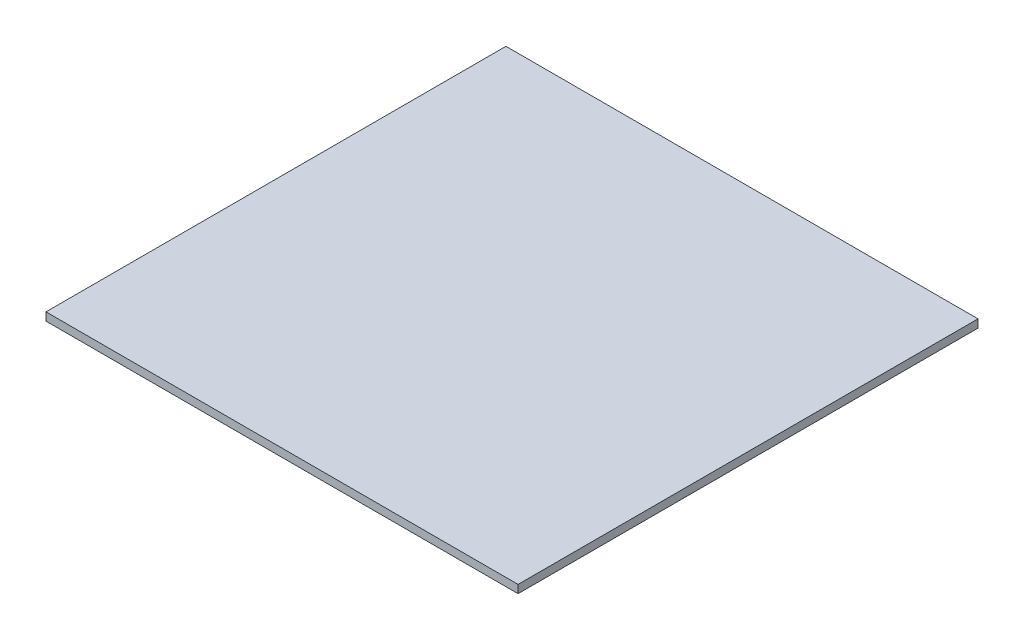
ISO-10303-21;
HEADER;
FILE_DESCRIPTION(('STEP AP214'),'2;1');
FILE_NAME('part.step','',(''),(''),'','','');
FILE_SCHEMA(('AUTOMOTIVE_DESIGN { 1 0 10303 214 1 1 1 1 }'));
ENDSEC;
DATA;
#1=APPLICATION_CONTEXT('core data for automotive mechanical design processes');
#2=APPLICATION_PROTOCOL_DEFINITION('international standard','automotive_design',2000,#1);
#3=PRODUCT_CONTEXT('',#1,'mechanical');
#4=PRODUCT('Part','Part','',(#3));
#5=PRODUCT_RELATED_PRODUCT_CATEGORY('part','',(#4));
#6=PRODUCT_DEFINITION_FORMATION('','',#4);
#7=PRODUCT_DEFINITION_CONTEXT('part definition',#1,'design');
#8=PRODUCT_DEFINITION('design','',#6,#7);
#9=PRODUCT_DEFINITION_SHAPE('','',#8);
#10=(LENGTH_UNIT() NAMED_UNIT(*) SI_UNIT(.MILLI.,.METRE.));
#11=(NAMED_UNIT(*) PLANE_ANGLE_UNIT() SI_UNIT($,.RADIAN.));
#12=(NAMED_UNIT(*) SI_UNIT($,.STERADIAN.) SOLID_ANGLE_UNIT());
#13=UNCERTAINTY_MEASURE_WITH_UNIT(LENGTH_MEASURE(1.E-05),#10,'distance_accuracy_value','');
#14=(GEOMETRIC_REPRESENTATION_CONTEXT(3) GLOBAL_UNCERTAINTY_ASSIGNED_CONTEXT((#13)) GLOBAL_UNIT_ASSIGNED_CONTEXT((#10,
#11,#12)) REPRESENTATION_CONTEXT('',''));
#15=CARTESIAN_POINT('',(0.,0.,0.));
#16=DIRECTION('',(0.,0.,1.));
#17=DIRECTION('',(1.,0.,0.));
#18=AXIS2_PLACEMENT_3D('',#15,#16,#17);
#19=CARTESIAN_POINT('',(10900.,20525.,5700.00000000006));
#20=DIRECTION('',(-1.,0.,0.));
#21=DIRECTION('',(0.,0.,1.));
#22=AXIS2_PLACEMENT_3D('',#19,#20,#21);
#23=PLANE('',#22);
#24=DIRECTION('',(0.,0.,-1.));
#25=VECTOR('',#24,1.);
#26=CARTESIAN_POINT('',(10900.,20425.,5700.00000000006));
#27=LINE('',#26,#25);
#28=CARTESIAN_POINT('',(10900.,20425.,5700.00000000006));
#29=VERTEX_POINT('',#28);
#30=CARTESIAN_POINT('',(10900.,20425.,6.3948846218409E-11));
#31=VERTEX_POINT('',#30);
#32=EDGE_CURVE('E93',#29,#31,#27,.T.);
#33=ORIENTED_EDGE('',*,*,#32,.T.);
#34=DIRECTION('',(0.,-1.,0.));
#35=VECTOR('',#34,1.);
#36=CARTESIAN_POINT('',(10900.,20525.,6.3948846218409E-11));
#37=LINE('',#36,#35);
#38=CARTESIAN_POINT('',(10900.,20525.,6.3948846218409E-11));
#39=VERTEX_POINT('',#38);
#40=EDGE_CURVE('E11',#39,#31,#37,.T.);
#41=ORIENTED_EDGE('',*,*,#40,.F.);
#42=DIRECTION('',(0.,0.,-1.));
#43=VECTOR('',#42,1.);
#44=CARTESIAN_POINT('',(10900.,20525.,5700.00000000006));
#45=LINE('',#44,#43);
#46=CARTESIAN_POINT('',(10900.,20525.,5700.00000000006));
#47=VERTEX_POINT('',#46);
#48=EDGE_CURVE('E81',#47,#39,#45,.T.);
#49=ORIENTED_EDGE('',*,*,#48,.F.);
#50=DIRECTION('',(0.,-1.,0.));
#51=VECTOR('',#50,1.);
#52=CARTESIAN_POINT('',(10900.,20525.,5700.00000000006));
#53=LINE('',#52,#51);
#54=EDGE_CURVE('E89',#47,#29,#53,.T.);
#55=ORIENTED_EDGE('',*,*,#54,.T.);
#56=EDGE_LOOP('',(#33,#41,#49,#55));
#57=FACE_BOUND('',#56,.T.);
#58=ADVANCED_FACE('F30',(#57),#23,.F.);
#59=CARTESIAN_POINT('',(10900.,20525.,6.3948846218409E-11));
#60=DIRECTION('',(0.,0.,1.));
#61=DIRECTION('',(1.,0.,0.));
#62=AXIS2_PLACEMENT_3D('',#59,#60,#61);
#63=PLANE('',#62);
#64=DIRECTION('',(-1.,0.,0.));
#65=VECTOR('',#64,1.);
#66=CARTESIAN_POINT('',(10900.,20425.,6.3948846218409E-11));
#67=LINE('',#66,#65);
#68=CARTESIAN_POINT('',(5050.,20425.,7.46069872548105E-11));
#69=VERTEX_POINT('',#68);
#70=EDGE_CURVE('E85',#31,#69,#67,.T.);
#71=ORIENTED_EDGE('',*,*,#70,.T.);
#72=DIRECTION('',(0.,-1.,0.));
#73=VECTOR('',#72,1.);
#74=CARTESIAN_POINT('',(5050.,20525.,7.46069872548105E-11));
#75=LINE('',#74,#73);
#76=CARTESIAN_POINT('',(5050.,20525.,7.46069872548105E-11));
#77=VERTEX_POINT('',#76);
#78=EDGE_CURVE('E38',#77,#69,#75,.T.);
#79=ORIENTED_EDGE('',*,*,#78,.F.);
#80=DIRECTION('',(-1.,0.,0.));
#81=VECTOR('',#80,1.);
#82=CARTESIAN_POINT('',(10900.,20525.,6.3948846218409E-11));
#83=LINE('',#82,#81);
#84=EDGE_CURVE('E76',#39,#77,#83,.T.);
#85=ORIENTED_EDGE('',*,*,#84,.F.);
#86=ORIENTED_EDGE('',*,*,#40,.T.);
#87=EDGE_LOOP('',(#71,#79,#85,#86));
#88=FACE_BOUND('',#87,.T.);
#89=ADVANCED_FACE('F84',(#88),#63,.F.);
#90=CARTESIAN_POINT('',(5050.,20525.,5700.00000000001));
#91=DIRECTION('',(1.,0.,0.));
#92=DIRECTION('',(0.,0.,-1.));
#93=AXIS2_PLACEMENT_3D('',#90,#91,#92);
#94=PLANE('',#93);
#95=DIRECTION('',(0.,0.,1.));
#96=VECTOR('',#95,1.);
#97=CARTESIAN_POINT('',(5050.,20425.,5700.00000000001));
#98=LINE('',#97,#96);
#99=CARTESIAN_POINT('',(5050.,20425.,5700.00000000001));
#100=VERTEX_POINT('',#99);
#101=EDGE_CURVE('E63',#69,#100,#98,.T.);
#102=ORIENTED_EDGE('',*,*,#101,.T.);
#103=DIRECTION('',(0.,-1.,0.));
#104=VECTOR('',#103,1.);
#105=CARTESIAN_POINT('',(5050.,20525.,5700.00000000001));
#106=LINE('',#105,#104);
#107=CARTESIAN_POINT('',(5050.,20525.,5700.00000000001));
#108=VERTEX_POINT('',#107);
#109=EDGE_CURVE('E86',#108,#100,#106,.T.);
#110=ORIENTED_EDGE('',*,*,#109,.F.);
#111=DIRECTION('',(0.,0.,1.));
#112=VECTOR('',#111,1.);
#113=CARTESIAN_POINT('',(5050.,20525.,5700.00000000001));
#114=LINE('',#113,#112);
#115=EDGE_CURVE('E79',#77,#108,#114,.T.);
#116=ORIENTED_EDGE('',*,*,#115,.F.);
#117=ORIENTED_EDGE('',*,*,#78,.T.);
#118=EDGE_LOOP('',(#102,#110,#116,#117));
#119=FACE_BOUND('',#118,.T.);
#120=ADVANCED_FACE('F87',(#119),#94,.F.);
#121=CARTESIAN_POINT('',(10900.,20525.,5700.00000000006));
#122=DIRECTION('',(0.,0.,-1.));
#123=DIRECTION('',(-1.,0.,0.));
#124=AXIS2_PLACEMENT_3D('',#121,#122,#123);
#125=PLANE('',#124);
#126=DIRECTION('',(1.,0.,0.));
#127=VECTOR('',#126,1.);
#128=CARTESIAN_POINT('',(10900.,20425.,5700.00000000006));
#129=LINE('',#128,#127);
#130=EDGE_CURVE('E69',#100,#29,#129,.T.);
#131=ORIENTED_EDGE('',*,*,#130,.T.);
#132=ORIENTED_EDGE('',*,*,#54,.F.);
#133=DIRECTION('',(1.,0.,0.));
#134=VECTOR('',#133,1.);
#135=CARTESIAN_POINT('',(10900.,20525.,5700.00000000006));
#136=LINE('',#135,#134);
#137=EDGE_CURVE('E46',#108,#47,#136,.T.);
#138=ORIENTED_EDGE('',*,*,#137,.F.);
#139=ORIENTED_EDGE('',*,*,#109,.T.);
#140=EDGE_LOOP('',(#131,#132,#138,#139));
#141=FACE_BOUND('',#140,.T.);
#142=ADVANCED_FACE('F100',(#141),#125,.F.);
#143=CARTESIAN_POINT('',(10900.,20525.,6.3948846218409E-11));
#144=DIRECTION('',(0.,1.,0.));
#145=DIRECTION('',(0.,0.,1.));
#146=AXIS2_PLACEMENT_3D('',#143,#144,#145);
#147=PLANE('',#146);
#148=ORIENTED_EDGE('',*,*,#48,.T.);
#149=ORIENTED_EDGE('',*,*,#84,.T.);
#150=ORIENTED_EDGE('',*,*,#115,.T.);
#151=ORIENTED_EDGE('',*,*,#137,.T.);
#152=EDGE_LOOP('',(#148,#149,#150,#151));
#153=FACE_BOUND('',#152,.T.);
#154=ADVANCED_FACE('F77',(#153),#147,.T.);
#155=CARTESIAN_POINT('',(10900.,20425.,6.3948846218409E-11));
#156=DIRECTION('',(0.,1.,0.));
#157=DIRECTION('',(0.,0.,1.));
#158=AXIS2_PLACEMENT_3D('',#155,#156,#157);
#159=PLANE('',#158);
#160=ORIENTED_EDGE('',*,*,#32,.F.);
#161=ORIENTED_EDGE('',*,*,#130,.F.);
#162=ORIENTED_EDGE('',*,*,#101,.F.);
#163=ORIENTED_EDGE('',*,*,#70,.F.);
#164=EDGE_LOOP('',(#160,#161,#162,#163));
#165=FACE_BOUND('',#164,.T.);
#166=ADVANCED_FACE('F103',(#165),#159,.F.);
#167=CLOSED_SHELL('',(#58,#89,#120,#142,#154,#166));
#168=MANIFOLD_SOLID_BREP('B2',#167);
#169=ADVANCED_BREP_SHAPE_REPRESENTATION('',(#18,#168),#14);
#170=SHAPE_DEFINITION_REPRESENTATION(#9,#169);
ENDSEC;
END-ISO-10303-21;
